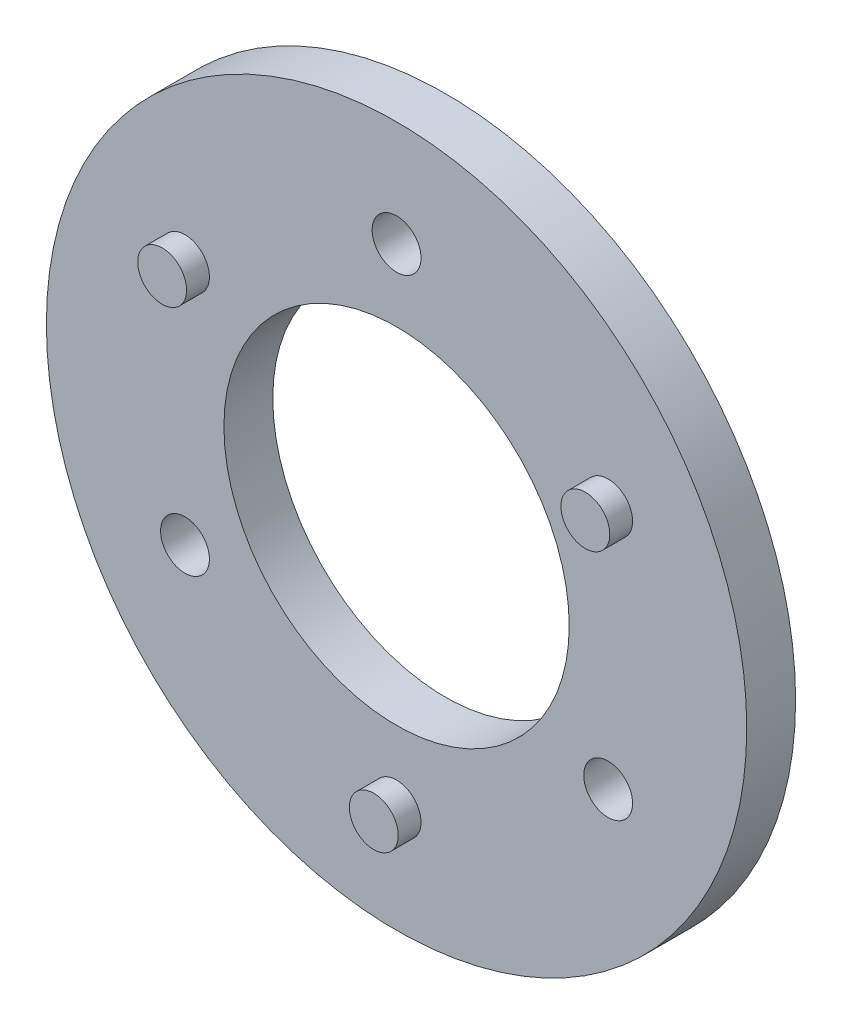
ISO-10303-21;
HEADER;
FILE_DESCRIPTION(('STEP AP214'),'2;1');
FILE_NAME('part.step','',(''),(''),'','','');
FILE_SCHEMA(('AUTOMOTIVE_DESIGN { 1 0 10303 214 1 1 1 1 }'));
ENDSEC;
DATA;
#1=APPLICATION_CONTEXT('core data for automotive mechanical design processes');
#2=APPLICATION_PROTOCOL_DEFINITION('international standard','automotive_design',2000,#1);
#3=PRODUCT_CONTEXT('',#1,'mechanical');
#4=PRODUCT('Part','Part','',(#3));
#5=PRODUCT_RELATED_PRODUCT_CATEGORY('part','',(#4));
#6=PRODUCT_DEFINITION_FORMATION('','',#4);
#7=PRODUCT_DEFINITION_CONTEXT('part definition',#1,'design');
#8=PRODUCT_DEFINITION('design','',#6,#7);
#9=PRODUCT_DEFINITION_SHAPE('','',#8);
#10=(LENGTH_UNIT() NAMED_UNIT(*) SI_UNIT(.MILLI.,.METRE.));
#11=(NAMED_UNIT(*) PLANE_ANGLE_UNIT() SI_UNIT($,.RADIAN.));
#12=(NAMED_UNIT(*) SI_UNIT($,.STERADIAN.) SOLID_ANGLE_UNIT());
#13=UNCERTAINTY_MEASURE_WITH_UNIT(LENGTH_MEASURE(1.E-05),#10,'distance_accuracy_value','');
#14=(GEOMETRIC_REPRESENTATION_CONTEXT(3) GLOBAL_UNCERTAINTY_ASSIGNED_CONTEXT((#13)) GLOBAL_UNIT_ASSIGNED_CONTEXT((#10,
#11,#12)) REPRESENTATION_CONTEXT('',''));
#15=CARTESIAN_POINT('',(0.,0.,0.));
#16=DIRECTION('',(0.,0.,1.));
#17=DIRECTION('',(1.,0.,0.));
#18=AXIS2_PLACEMENT_3D('',#15,#16,#17);
#19=CARTESIAN_POINT('',(0.,0.,3.));
#20=DIRECTION('',(0.,0.,1.));
#21=DIRECTION('',(1.,0.,0.));
#22=AXIS2_PLACEMENT_3D('',#19,#20,#21);
#23=PLANE('',#22);
#24=CARTESIAN_POINT('',(1.14908083048704E-13,-15.,3.));
#25=DIRECTION('',(0.,0.,1.));
#26=DIRECTION('',(1.,0.,0.));
#27=AXIS2_PLACEMENT_3D('',#24,#25,#26);
#28=CIRCLE('',#27,1.5);
#29=CARTESIAN_POINT('',(1.50000000000012,-15.,3.));
#30=VERTEX_POINT('',#29);
#31=EDGE_CURVE('E80',#30,#30,#28,.T.);
#32=ORIENTED_EDGE('',*,*,#31,.F.);
#33=EDGE_LOOP('',(#32));
#34=FACE_BOUND('',#33,.T.);
#35=CARTESIAN_POINT('',(-12.9903810567666,7.49999999999996,3.));
#36=DIRECTION('',(0.,0.,1.));
#37=DIRECTION('',(1.,0.,0.));
#38=AXIS2_PLACEMENT_3D('',#35,#36,#37);
#39=CIRCLE('',#38,1.5);
#40=CARTESIAN_POINT('',(-11.4903810567666,7.49999999999996,3.));
#41=VERTEX_POINT('',#40);
#42=EDGE_CURVE('E74',#41,#41,#39,.T.);
#43=ORIENTED_EDGE('',*,*,#42,.F.);
#44=EDGE_LOOP('',(#43));
#45=FACE_BOUND('',#44,.T.);
#46=CARTESIAN_POINT('',(12.9903810567666,7.49999999999997,3.));
#47=DIRECTION('',(0.,0.,1.));
#48=DIRECTION('',(1.,0.,0.));
#49=AXIS2_PLACEMENT_3D('',#46,#47,#48);
#50=CIRCLE('',#49,1.5);
#51=CARTESIAN_POINT('',(14.4903810567666,7.49999999999997,3.));
#52=VERTEX_POINT('',#51);
#53=EDGE_CURVE('E68',#52,#52,#50,.T.);
#54=ORIENTED_EDGE('',*,*,#53,.F.);
#55=EDGE_LOOP('',(#54));
#56=FACE_BOUND('',#55,.T.);
#57=CARTESIAN_POINT('',(12.9903810567665,-7.50000000000006,3.));
#58=DIRECTION('',(0.,0.,1.));
#59=DIRECTION('',(1.,0.,0.));
#60=AXIS2_PLACEMENT_3D('',#57,#58,#59);
#61=CIRCLE('',#60,1.5);
#62=CARTESIAN_POINT('',(14.4903810567665,-7.50000000000006,3.));
#63=VERTEX_POINT('',#62);
#64=EDGE_CURVE('E53',#63,#63,#61,.T.);
#65=ORIENTED_EDGE('',*,*,#64,.F.);
#66=EDGE_LOOP('',(#65));
#67=FACE_BOUND('',#66,.T.);
#68=CARTESIAN_POINT('',(0.,0.,3.));
#69=DIRECTION('',(0.,0.,1.));
#70=DIRECTION('',(1.,0.,0.));
#71=AXIS2_PLACEMENT_3D('',#68,#69,#70);
#72=CIRCLE('',#71,10.6);
#73=CARTESIAN_POINT('',(10.6,0.,3.));
#74=VERTEX_POINT('',#73);
#75=EDGE_CURVE('E42',#74,#74,#72,.T.);
#76=ORIENTED_EDGE('',*,*,#75,.F.);
#77=EDGE_LOOP('',(#76));
#78=FACE_BOUND('',#77,.T.);
#79=CARTESIAN_POINT('',(0.,0.,3.));
#80=DIRECTION('',(0.,0.,1.));
#81=DIRECTION('',(1.,0.,0.));
#82=AXIS2_PLACEMENT_3D('',#79,#80,#81);
#83=CIRCLE('',#82,21.5);
#84=CARTESIAN_POINT('',(21.5,0.,3.));
#85=VERTEX_POINT('',#84);
#86=EDGE_CURVE('E10',#85,#85,#83,.T.);
#87=ORIENTED_EDGE('',*,*,#86,.T.);
#88=EDGE_LOOP('',(#87));
#89=FACE_BOUND('',#88,.T.);
#90=CARTESIAN_POINT('',(0.,15.,3.));
#91=DIRECTION('',(0.,0.,1.));
#92=DIRECTION('',(1.,0.,0.));
#93=AXIS2_PLACEMENT_3D('',#90,#91,#92);
#94=CIRCLE('',#93,1.5);
#95=CARTESIAN_POINT('',(1.5,15.,3.));
#96=VERTEX_POINT('',#95);
#97=EDGE_CURVE('E47',#96,#96,#94,.T.);
#98=ORIENTED_EDGE('',*,*,#97,.F.);
#99=EDGE_LOOP('',(#98));
#100=FACE_BOUND('',#99,.T.);
#101=CARTESIAN_POINT('',(-12.9903810567667,-7.49999999999988,3.));
#102=DIRECTION('',(0.,0.,1.));
#103=DIRECTION('',(1.,0.,0.));
#104=AXIS2_PLACEMENT_3D('',#101,#102,#103);
#105=CIRCLE('',#104,1.5);
#106=CARTESIAN_POINT('',(-11.4903810567667,-7.49999999999988,3.));
#107=VERTEX_POINT('',#106);
#108=EDGE_CURVE('E59',#107,#107,#105,.T.);
#109=ORIENTED_EDGE('',*,*,#108,.F.);
#110=EDGE_LOOP('',(#109));
#111=FACE_BOUND('',#110,.T.);
#112=ADVANCED_FACE('F31',(#34,#45,#56,#67,#78,#89,#100,#111),#23,.T.);
#113=CARTESIAN_POINT('',(0.,0.,0.));
#114=DIRECTION('',(0.,0.,1.));
#115=DIRECTION('',(1.,0.,0.));
#116=AXIS2_PLACEMENT_3D('',#113,#114,#115);
#117=PLANE('',#116);
#118=CARTESIAN_POINT('',(0.,0.,0.));
#119=DIRECTION('',(0.,0.,1.));
#120=DIRECTION('',(1.,0.,0.));
#121=AXIS2_PLACEMENT_3D('',#118,#119,#120);
#122=CIRCLE('',#121,21.5);
#123=CARTESIAN_POINT('',(21.5,0.,0.));
#124=VERTEX_POINT('',#123);
#125=EDGE_CURVE('E35',#124,#124,#122,.T.);
#126=ORIENTED_EDGE('',*,*,#125,.F.);
#127=EDGE_LOOP('',(#126));
#128=FACE_BOUND('',#127,.T.);
#129=CARTESIAN_POINT('',(0.,0.,0.));
#130=DIRECTION('',(0.,0.,1.));
#131=DIRECTION('',(1.,0.,0.));
#132=AXIS2_PLACEMENT_3D('',#129,#130,#131);
#133=CIRCLE('',#132,10.6);
#134=CARTESIAN_POINT('',(10.6,0.,0.));
#135=VERTEX_POINT('',#134);
#136=EDGE_CURVE('E44',#135,#135,#133,.T.);
#137=ORIENTED_EDGE('',*,*,#136,.T.);
#138=EDGE_LOOP('',(#137));
#139=FACE_BOUND('',#138,.T.);
#140=CARTESIAN_POINT('',(0.,15.,0.));
#141=DIRECTION('',(0.,0.,1.));
#142=DIRECTION('',(1.,0.,0.));
#143=AXIS2_PLACEMENT_3D('',#140,#141,#142);
#144=CIRCLE('',#143,1.5);
#145=CARTESIAN_POINT('',(1.5,15.,0.));
#146=VERTEX_POINT('',#145);
#147=EDGE_CURVE('E50',#146,#146,#144,.T.);
#148=ORIENTED_EDGE('',*,*,#147,.T.);
#149=EDGE_LOOP('',(#148));
#150=FACE_BOUND('',#149,.T.);
#151=CARTESIAN_POINT('',(12.9903810567665,-7.50000000000006,0.));
#152=DIRECTION('',(0.,0.,1.));
#153=DIRECTION('',(1.,0.,0.));
#154=AXIS2_PLACEMENT_3D('',#151,#152,#153);
#155=CIRCLE('',#154,1.5);
#156=CARTESIAN_POINT('',(14.4903810567665,-7.50000000000006,0.));
#157=VERTEX_POINT('',#156);
#158=EDGE_CURVE('E56',#157,#157,#155,.T.);
#159=ORIENTED_EDGE('',*,*,#158,.T.);
#160=EDGE_LOOP('',(#159));
#161=FACE_BOUND('',#160,.T.);
#162=CARTESIAN_POINT('',(-12.9903810567667,-7.49999999999988,0.));
#163=DIRECTION('',(0.,0.,1.));
#164=DIRECTION('',(1.,0.,0.));
#165=AXIS2_PLACEMENT_3D('',#162,#163,#164);
#166=CIRCLE('',#165,1.5);
#167=CARTESIAN_POINT('',(-11.4903810567667,-7.49999999999988,0.));
#168=VERTEX_POINT('',#167);
#169=EDGE_CURVE('E62',#168,#168,#166,.T.);
#170=ORIENTED_EDGE('',*,*,#169,.T.);
#171=EDGE_LOOP('',(#170));
#172=FACE_BOUND('',#171,.T.);
#173=ADVANCED_FACE('F97',(#128,#139,#150,#161,#172),#117,.F.);
#174=CARTESIAN_POINT('',(0.,0.,3.));
#175=DIRECTION('',(0.,0.,-1.));
#176=DIRECTION('',(-1.,0.,0.));
#177=AXIS2_PLACEMENT_3D('',#174,#175,#176);
#178=CYLINDRICAL_SURFACE('',#177,21.5);
#179=ORIENTED_EDGE('',*,*,#86,.F.);
#180=EDGE_LOOP('',(#179));
#181=FACE_BOUND('',#180,.T.);
#182=ORIENTED_EDGE('',*,*,#125,.T.);
#183=EDGE_LOOP('',(#182));
#184=FACE_BOUND('',#183,.T.);
#185=ADVANCED_FACE('F33',(#181,#184),#178,.T.);
#186=CARTESIAN_POINT('',(0.,0.,3.));
#187=DIRECTION('',(0.,0.,-1.));
#188=DIRECTION('',(-1.,0.,0.));
#189=AXIS2_PLACEMENT_3D('',#186,#187,#188);
#190=CYLINDRICAL_SURFACE('',#189,10.6);
#191=ORIENTED_EDGE('',*,*,#75,.T.);
#192=EDGE_LOOP('',(#191));
#193=FACE_BOUND('',#192,.T.);
#194=ORIENTED_EDGE('',*,*,#136,.F.);
#195=EDGE_LOOP('',(#194));
#196=FACE_BOUND('',#195,.T.);
#197=ADVANCED_FACE('F125',(#193,#196),#190,.F.);
#198=CARTESIAN_POINT('',(0.,15.,3.));
#199=DIRECTION('',(0.,0.,-1.));
#200=DIRECTION('',(-1.,0.,0.));
#201=AXIS2_PLACEMENT_3D('',#198,#199,#200);
#202=CYLINDRICAL_SURFACE('',#201,1.5);
#203=ORIENTED_EDGE('',*,*,#97,.T.);
#204=EDGE_LOOP('',(#203));
#205=FACE_BOUND('',#204,.T.);
#206=ORIENTED_EDGE('',*,*,#147,.F.);
#207=EDGE_LOOP('',(#206));
#208=FACE_BOUND('',#207,.T.);
#209=ADVANCED_FACE('F132',(#205,#208),#202,.F.);
#210=CARTESIAN_POINT('',(12.9903810567665,-7.50000000000006,3.));
#211=DIRECTION('',(0.,0.,-1.));
#212=DIRECTION('',(-1.,0.,0.));
#213=AXIS2_PLACEMENT_3D('',#210,#211,#212);
#214=CYLINDRICAL_SURFACE('',#213,1.5);
#215=ORIENTED_EDGE('',*,*,#64,.T.);
#216=EDGE_LOOP('',(#215));
#217=FACE_BOUND('',#216,.T.);
#218=ORIENTED_EDGE('',*,*,#158,.F.);
#219=EDGE_LOOP('',(#218));
#220=FACE_BOUND('',#219,.T.);
#221=ADVANCED_FACE('F115',(#217,#220),#214,.F.);
#222=CARTESIAN_POINT('',(-12.9903810567667,-7.49999999999988,3.));
#223=DIRECTION('',(0.,0.,-1.));
#224=DIRECTION('',(-1.,0.,0.));
#225=AXIS2_PLACEMENT_3D('',#222,#223,#224);
#226=CYLINDRICAL_SURFACE('',#225,1.5);
#227=ORIENTED_EDGE('',*,*,#108,.T.);
#228=EDGE_LOOP('',(#227));
#229=FACE_BOUND('',#228,.T.);
#230=ORIENTED_EDGE('',*,*,#169,.F.);
#231=EDGE_LOOP('',(#230));
#232=FACE_BOUND('',#231,.T.);
#233=ADVANCED_FACE('F111',(#229,#232),#226,.F.);
#234=CARTESIAN_POINT('',(12.9903810567666,7.49999999999997,4.4));
#235=DIRECTION('',(0.,0.,-1.));
#236=DIRECTION('',(-1.,0.,0.));
#237=AXIS2_PLACEMENT_3D('',#234,#235,#236);
#238=CYLINDRICAL_SURFACE('',#237,1.5);
#239=CARTESIAN_POINT('',(12.9903810567666,7.49999999999997,4.4));
#240=DIRECTION('',(0.,0.,1.));
#241=DIRECTION('',(1.,0.,0.));
#242=AXIS2_PLACEMENT_3D('',#239,#240,#241);
#243=CIRCLE('',#242,1.5);
#244=CARTESIAN_POINT('',(14.4903810567666,7.49999999999997,4.4));
#245=VERTEX_POINT('',#244);
#246=EDGE_CURVE('E65',#245,#245,#243,.T.);
#247=ORIENTED_EDGE('',*,*,#246,.F.);
#248=EDGE_LOOP('',(#247));
#249=FACE_BOUND('',#248,.T.);
#250=ORIENTED_EDGE('',*,*,#53,.T.);
#251=EDGE_LOOP('',(#250));
#252=FACE_BOUND('',#251,.T.);
#253=ADVANCED_FACE('F114',(#249,#252),#238,.T.);
#254=CARTESIAN_POINT('',(12.9903810567666,7.49999999999997,4.4));
#255=DIRECTION('',(0.,0.,1.));
#256=DIRECTION('',(1.,0.,0.));
#257=AXIS2_PLACEMENT_3D('',#254,#255,#256);
#258=PLANE('',#257);
#259=ORIENTED_EDGE('',*,*,#246,.T.);
#260=EDGE_LOOP('',(#259));
#261=FACE_BOUND('',#260,.T.);
#262=ADVANCED_FACE('F142',(#261),#258,.T.);
#263=CARTESIAN_POINT('',(-12.9903810567666,7.49999999999996,4.4));
#264=DIRECTION('',(0.,0.,-1.));
#265=DIRECTION('',(-1.,0.,0.));
#266=AXIS2_PLACEMENT_3D('',#263,#264,#265);
#267=CYLINDRICAL_SURFACE('',#266,1.5);
#268=CARTESIAN_POINT('',(-12.9903810567666,7.49999999999996,4.4));
#269=DIRECTION('',(0.,0.,1.));
#270=DIRECTION('',(1.,0.,0.));
#271=AXIS2_PLACEMENT_3D('',#268,#269,#270);
#272=CIRCLE('',#271,1.5);
#273=CARTESIAN_POINT('',(-11.4903810567666,7.49999999999996,4.4));
#274=VERTEX_POINT('',#273);
#275=EDGE_CURVE('E71',#274,#274,#272,.T.);
#276=ORIENTED_EDGE('',*,*,#275,.F.);
#277=EDGE_LOOP('',(#276));
#278=FACE_BOUND('',#277,.T.);
#279=ORIENTED_EDGE('',*,*,#42,.T.);
#280=EDGE_LOOP('',(#279));
#281=FACE_BOUND('',#280,.T.);
#282=ADVANCED_FACE('F146',(#278,#281),#267,.T.);
#283=CARTESIAN_POINT('',(-12.9903810567666,7.49999999999996,4.4));
#284=DIRECTION('',(0.,0.,1.));
#285=DIRECTION('',(1.,0.,0.));
#286=AXIS2_PLACEMENT_3D('',#283,#284,#285);
#287=PLANE('',#286);
#288=ORIENTED_EDGE('',*,*,#275,.T.);
#289=EDGE_LOOP('',(#288));
#290=FACE_BOUND('',#289,.T.);
#291=ADVANCED_FACE('F91',(#290),#287,.T.);
#292=CARTESIAN_POINT('',(1.14908083048704E-13,-15.,4.4));
#293=DIRECTION('',(0.,0.,-1.));
#294=DIRECTION('',(-1.,0.,0.));
#295=AXIS2_PLACEMENT_3D('',#292,#293,#294);
#296=CYLINDRICAL_SURFACE('',#295,1.5);
#297=CARTESIAN_POINT('',(1.14908083048704E-13,-15.,4.4));
#298=DIRECTION('',(0.,0.,1.));
#299=DIRECTION('',(1.,0.,0.));
#300=AXIS2_PLACEMENT_3D('',#297,#298,#299);
#301=CIRCLE('',#300,1.5);
#302=CARTESIAN_POINT('',(1.50000000000012,-15.,4.4));
#303=VERTEX_POINT('',#302);
#304=EDGE_CURVE('E77',#303,#303,#301,.T.);
#305=ORIENTED_EDGE('',*,*,#304,.F.);
#306=EDGE_LOOP('',(#305));
#307=FACE_BOUND('',#306,.T.);
#308=ORIENTED_EDGE('',*,*,#31,.T.);
#309=EDGE_LOOP('',(#308));
#310=FACE_BOUND('',#309,.T.);
#311=ADVANCED_FACE('F88',(#307,#310),#296,.T.);
#312=CARTESIAN_POINT('',(1.14908083048704E-13,-15.,4.4));
#313=DIRECTION('',(0.,0.,1.));
#314=DIRECTION('',(1.,0.,0.));
#315=AXIS2_PLACEMENT_3D('',#312,#313,#314);
#316=PLANE('',#315);
#317=ORIENTED_EDGE('',*,*,#304,.T.);
#318=EDGE_LOOP('',(#317));
#319=FACE_BOUND('',#318,.T.);
#320=ADVANCED_FACE('F86',(#319),#316,.T.);
#321=CLOSED_SHELL('',(#112,#173,#185,#197,#209,#221,#233,#253,#262,#282,#291,#311,#320));
#322=MANIFOLD_SOLID_BREP('B2',#321);
#323=ADVANCED_BREP_SHAPE_REPRESENTATION('',(#18,#322),#14);
#324=SHAPE_DEFINITION_REPRESENTATION(#9,#323);
ENDSEC;
END-ISO-10303-21;
